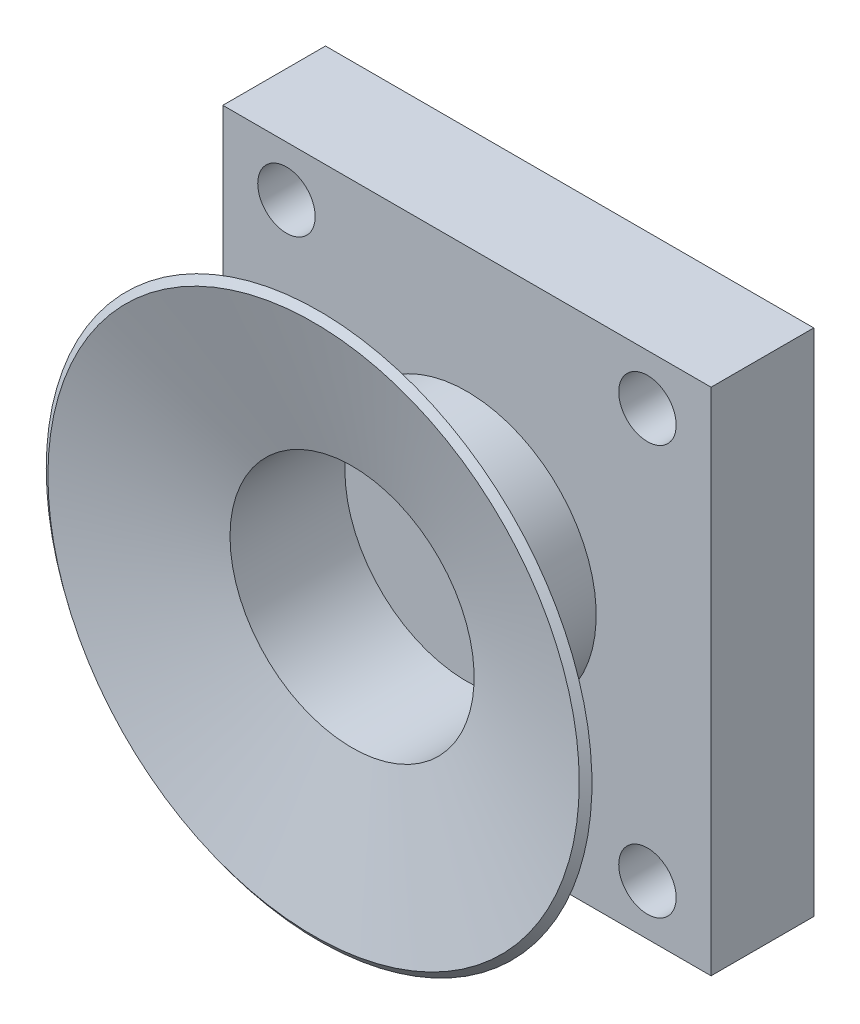
ISO-10303-21;
HEADER;
FILE_DESCRIPTION(('STEP AP214'),'2;1');
FILE_NAME('part.step','',(''),(''),'','','');
FILE_SCHEMA(('AUTOMOTIVE_DESIGN { 1 0 10303 214 1 1 1 1 }'));
ENDSEC;
DATA;
#1=APPLICATION_CONTEXT('core data for automotive mechanical design processes');
#2=APPLICATION_PROTOCOL_DEFINITION('international standard','automotive_design',2000,#1);
#3=PRODUCT_CONTEXT('',#1,'mechanical');
#4=PRODUCT('Part','Part','',(#3));
#5=PRODUCT_RELATED_PRODUCT_CATEGORY('part','',(#4));
#6=PRODUCT_DEFINITION_FORMATION('','',#4);
#7=PRODUCT_DEFINITION_CONTEXT('part definition',#1,'design');
#8=PRODUCT_DEFINITION('design','',#6,#7);
#9=PRODUCT_DEFINITION_SHAPE('','',#8);
#10=(LENGTH_UNIT() NAMED_UNIT(*) SI_UNIT(.MILLI.,.METRE.));
#11=(NAMED_UNIT(*) PLANE_ANGLE_UNIT() SI_UNIT($,.RADIAN.));
#12=(NAMED_UNIT(*) SI_UNIT($,.STERADIAN.) SOLID_ANGLE_UNIT());
#13=UNCERTAINTY_MEASURE_WITH_UNIT(LENGTH_MEASURE(1.E-05),#10,'distance_accuracy_value','');
#14=(GEOMETRIC_REPRESENTATION_CONTEXT(3) GLOBAL_UNCERTAINTY_ASSIGNED_CONTEXT((#13)) GLOBAL_UNIT_ASSIGNED_CONTEXT((#10,
#11,#12)) REPRESENTATION_CONTEXT('',''));
#15=CARTESIAN_POINT('',(0.,0.,0.));
#16=DIRECTION('',(0.,0.,1.));
#17=DIRECTION('',(1.,0.,0.));
#18=AXIS2_PLACEMENT_3D('',#15,#16,#17);
#19=CARTESIAN_POINT('',(0.,0.,7.15));
#20=DIRECTION('',(0.,0.,-1.));
#21=DIRECTION('',(-1.,0.,0.));
#22=AXIS2_PLACEMENT_3D('',#19,#20,#21);
#23=PLANE('',#22);
#24=CARTESIAN_POINT('',(17.,17.75,7.15));
#25=DIRECTION('',(0.,0.,-1.));
#26=DIRECTION('',(-1.,0.,0.));
#27=AXIS2_PLACEMENT_3D('',#24,#25,#26);
#28=CIRCLE('',#27,9.);
#29=CARTESIAN_POINT('',(8.,17.75,7.15));
#30=VERTEX_POINT('',#29);
#31=EDGE_CURVE('E312',#30,#30,#28,.T.);
#32=ORIENTED_EDGE('',*,*,#31,.T.);
#33=EDGE_LOOP('',(#32));
#34=FACE_BOUND('',#33,.T.);
#35=DIRECTION('',(1.,0.,0.));
#36=VECTOR('',#35,1.);
#37=CARTESIAN_POINT('',(34.,0.,7.15));
#38=LINE('',#37,#36);
#39=CARTESIAN_POINT('',(0.,0.,7.15));
#40=VERTEX_POINT('',#39);
#41=CARTESIAN_POINT('',(34.,0.,7.15));
#42=VERTEX_POINT('',#41);
#43=EDGE_CURVE('E90',#40,#42,#38,.T.);
#44=ORIENTED_EDGE('',*,*,#43,.T.);
#45=DIRECTION('',(0.,1.,0.));
#46=VECTOR('',#45,1.);
#47=CARTESIAN_POINT('',(34.,35.5,7.15));
#48=LINE('',#47,#46);
#49=CARTESIAN_POINT('',(34.,35.5,7.15));
#50=VERTEX_POINT('',#49);
#51=EDGE_CURVE('E85',#42,#50,#48,.T.);
#52=ORIENTED_EDGE('',*,*,#51,.T.);
#53=DIRECTION('',(-1.,0.,0.));
#54=VECTOR('',#53,1.);
#55=CARTESIAN_POINT('',(0.,35.5,7.15));
#56=LINE('',#55,#54);
#57=CARTESIAN_POINT('',(0.,35.5,7.15));
#58=VERTEX_POINT('',#57);
#59=EDGE_CURVE('E88',#50,#58,#56,.T.);
#60=ORIENTED_EDGE('',*,*,#59,.T.);
#61=DIRECTION('',(0.,-1.,0.));
#62=VECTOR('',#61,1.);
#63=CARTESIAN_POINT('',(0.,0.,7.15));
#64=LINE('',#63,#62);
#65=EDGE_CURVE('E54',#58,#40,#64,.T.);
#66=ORIENTED_EDGE('',*,*,#65,.T.);
#67=EDGE_LOOP('',(#44,#52,#60,#66));
#68=FACE_BOUND('',#67,.T.);
#69=CARTESIAN_POINT('',(4.43152626751353,3.5,7.15));
#70=DIRECTION('',(0.,0.,1.));
#71=DIRECTION('',(1.,0.,0.));
#72=AXIS2_PLACEMENT_3D('',#69,#70,#71);
#73=CIRCLE('',#72,2.);
#74=CARTESIAN_POINT('',(6.43152626751353,3.5,7.15));
#75=VERTEX_POINT('',#74);
#76=EDGE_CURVE('E107',#75,#75,#73,.T.);
#77=ORIENTED_EDGE('',*,*,#76,.F.);
#78=EDGE_LOOP('',(#77));
#79=FACE_BOUND('',#78,.T.);
#80=CARTESIAN_POINT('',(29.5684737324865,3.5,7.15));
#81=DIRECTION('',(0.,0.,1.));
#82=DIRECTION('',(-1.,0.,0.));
#83=AXIS2_PLACEMENT_3D('',#80,#81,#82);
#84=CIRCLE('',#83,2.);
#85=CARTESIAN_POINT('',(27.5684737324865,3.5,7.15));
#86=VERTEX_POINT('',#85);
#87=EDGE_CURVE('E143',#86,#86,#84,.T.);
#88=ORIENTED_EDGE('',*,*,#87,.F.);
#89=EDGE_LOOP('',(#88));
#90=FACE_BOUND('',#89,.T.);
#91=CARTESIAN_POINT('',(29.5684737324865,32.,7.15));
#92=DIRECTION('',(0.,0.,1.));
#93=DIRECTION('',(1.,0.,0.));
#94=AXIS2_PLACEMENT_3D('',#91,#92,#93);
#95=CIRCLE('',#94,2.);
#96=CARTESIAN_POINT('',(31.5684737324865,32.,7.15));
#97=VERTEX_POINT('',#96);
#98=EDGE_CURVE('E138',#97,#97,#95,.T.);
#99=ORIENTED_EDGE('',*,*,#98,.F.);
#100=EDGE_LOOP('',(#99));
#101=FACE_BOUND('',#100,.T.);
#102=CARTESIAN_POINT('',(4.43152626751353,32.,7.15));
#103=DIRECTION('',(0.,0.,1.));
#104=DIRECTION('',(-1.,0.,0.));
#105=AXIS2_PLACEMENT_3D('',#102,#103,#104);
#106=CIRCLE('',#105,2.);
#107=CARTESIAN_POINT('',(2.43152626751353,32.,7.15));
#108=VERTEX_POINT('',#107);
#109=EDGE_CURVE('E128',#108,#108,#106,.T.);
#110=ORIENTED_EDGE('',*,*,#109,.F.);
#111=EDGE_LOOP('',(#110));
#112=FACE_BOUND('',#111,.T.);
#113=ADVANCED_FACE('F37',(#34,#68,#79,#90,#101,#112),#23,.F.);
#114=CARTESIAN_POINT('',(0.,0.,0.));
#115=DIRECTION('',(0.,0.,-1.));
#116=DIRECTION('',(-1.,0.,0.));
#117=AXIS2_PLACEMENT_3D('',#114,#115,#116);
#118=PLANE('',#117);
#119=CARTESIAN_POINT('',(29.5684737324865,32.,0.));
#120=DIRECTION('',(0.,0.,1.));
#121=DIRECTION('',(1.,0.,0.));
#122=AXIS2_PLACEMENT_3D('',#119,#120,#121);
#123=CIRCLE('',#122,2.);
#124=CARTESIAN_POINT('',(31.5684737324865,32.,0.));
#125=VERTEX_POINT('',#124);
#126=EDGE_CURVE('E132',#125,#125,#123,.T.);
#127=ORIENTED_EDGE('',*,*,#126,.T.);
#128=EDGE_LOOP('',(#127));
#129=FACE_BOUND('',#128,.T.);
#130=CARTESIAN_POINT('',(4.43152626751353,3.5,0.));
#131=DIRECTION('',(0.,0.,1.));
#132=DIRECTION('',(1.,0.,0.));
#133=AXIS2_PLACEMENT_3D('',#130,#131,#132);
#134=CIRCLE('',#133,2.);
#135=CARTESIAN_POINT('',(6.43152626751353,3.5,0.));
#136=VERTEX_POINT('',#135);
#137=EDGE_CURVE('E146',#136,#136,#134,.T.);
#138=ORIENTED_EDGE('',*,*,#137,.T.);
#139=EDGE_LOOP('',(#138));
#140=FACE_BOUND('',#139,.T.);
#141=DIRECTION('',(1.,0.,0.));
#142=VECTOR('',#141,1.);
#143=CARTESIAN_POINT('',(34.,0.,0.));
#144=LINE('',#143,#142);
#145=CARTESIAN_POINT('',(0.,0.,0.));
#146=VERTEX_POINT('',#145);
#147=CARTESIAN_POINT('',(34.,0.,0.));
#148=VERTEX_POINT('',#147);
#149=EDGE_CURVE('E104',#146,#148,#144,.T.);
#150=ORIENTED_EDGE('',*,*,#149,.F.);
#151=DIRECTION('',(0.,-1.,0.));
#152=VECTOR('',#151,1.);
#153=CARTESIAN_POINT('',(0.,0.,0.));
#154=LINE('',#153,#152);
#155=CARTESIAN_POINT('',(0.,35.5,0.));
#156=VERTEX_POINT('',#155);
#157=EDGE_CURVE('E77',#156,#146,#154,.T.);
#158=ORIENTED_EDGE('',*,*,#157,.F.);
#159=DIRECTION('',(-1.,0.,0.));
#160=VECTOR('',#159,1.);
#161=CARTESIAN_POINT('',(0.,35.5,0.));
#162=LINE('',#161,#160);
#163=CARTESIAN_POINT('',(34.,35.5,0.));
#164=VERTEX_POINT('',#163);
#165=EDGE_CURVE('E71',#164,#156,#162,.T.);
#166=ORIENTED_EDGE('',*,*,#165,.F.);
#167=DIRECTION('',(0.,1.,0.));
#168=VECTOR('',#167,1.);
#169=CARTESIAN_POINT('',(34.,35.5,0.));
#170=LINE('',#169,#168);
#171=EDGE_CURVE('E95',#148,#164,#170,.T.);
#172=ORIENTED_EDGE('',*,*,#171,.F.);
#173=EDGE_LOOP('',(#150,#158,#166,#172));
#174=FACE_BOUND('',#173,.T.);
#175=CARTESIAN_POINT('',(29.5684737324865,3.5,0.));
#176=DIRECTION('',(0.,0.,1.));
#177=DIRECTION('',(-1.,0.,0.));
#178=AXIS2_PLACEMENT_3D('',#175,#176,#177);
#179=CIRCLE('',#178,2.);
#180=CARTESIAN_POINT('',(27.5684737324865,3.5,0.));
#181=VERTEX_POINT('',#180);
#182=EDGE_CURVE('E123',#181,#181,#179,.T.);
#183=ORIENTED_EDGE('',*,*,#182,.T.);
#184=EDGE_LOOP('',(#183));
#185=FACE_BOUND('',#184,.T.);
#186=CARTESIAN_POINT('',(4.43152626751353,32.,0.));
#187=DIRECTION('',(0.,0.,1.));
#188=DIRECTION('',(-1.,0.,0.));
#189=AXIS2_PLACEMENT_3D('',#186,#187,#188);
#190=CIRCLE('',#189,2.);
#191=CARTESIAN_POINT('',(2.43152626751353,32.,0.));
#192=VERTEX_POINT('',#191);
#193=EDGE_CURVE('E126',#192,#192,#190,.T.);
#194=ORIENTED_EDGE('',*,*,#193,.T.);
#195=EDGE_LOOP('',(#194));
#196=FACE_BOUND('',#195,.T.);
#197=ADVANCED_FACE('F115',(#129,#140,#174,#185,#196),#118,.T.);
#198=CARTESIAN_POINT('',(34.,0.,7.15));
#199=DIRECTION('',(0.,1.,0.));
#200=DIRECTION('',(-1.,0.,0.));
#201=AXIS2_PLACEMENT_3D('',#198,#199,#200);
#202=PLANE('',#201);
#203=ORIENTED_EDGE('',*,*,#149,.T.);
#204=DIRECTION('',(0.,0.,-1.));
#205=VECTOR('',#204,1.);
#206=CARTESIAN_POINT('',(34.,0.,7.15));
#207=LINE('',#206,#205);
#208=EDGE_CURVE('E46',#42,#148,#207,.T.);
#209=ORIENTED_EDGE('',*,*,#208,.F.);
#210=ORIENTED_EDGE('',*,*,#43,.F.);
#211=DIRECTION('',(0.,0.,-1.));
#212=VECTOR('',#211,1.);
#213=CARTESIAN_POINT('',(0.,0.,7.15));
#214=LINE('',#213,#212);
#215=EDGE_CURVE('E100',#40,#146,#214,.T.);
#216=ORIENTED_EDGE('',*,*,#215,.T.);
#217=EDGE_LOOP('',(#203,#209,#210,#216));
#218=FACE_BOUND('',#217,.T.);
#219=ADVANCED_FACE('F39',(#218),#202,.F.);
#220=CARTESIAN_POINT('',(34.,35.5,7.15));
#221=DIRECTION('',(-1.,0.,0.));
#222=DIRECTION('',(0.,-1.,0.));
#223=AXIS2_PLACEMENT_3D('',#220,#221,#222);
#224=PLANE('',#223);
#225=ORIENTED_EDGE('',*,*,#171,.T.);
#226=DIRECTION('',(0.,0.,-1.));
#227=VECTOR('',#226,1.);
#228=CARTESIAN_POINT('',(34.,35.5,7.15));
#229=LINE('',#228,#227);
#230=EDGE_CURVE('E93',#50,#164,#229,.T.);
#231=ORIENTED_EDGE('',*,*,#230,.F.);
#232=ORIENTED_EDGE('',*,*,#51,.F.);
#233=ORIENTED_EDGE('',*,*,#208,.T.);
#234=EDGE_LOOP('',(#225,#231,#232,#233));
#235=FACE_BOUND('',#234,.T.);
#236=ADVANCED_FACE('F94',(#235),#224,.F.);
#237=CARTESIAN_POINT('',(0.,35.5,7.15));
#238=DIRECTION('',(0.,-1.,0.));
#239=DIRECTION('',(0.,0.,-1.));
#240=AXIS2_PLACEMENT_3D('',#237,#238,#239);
#241=PLANE('',#240);
#242=ORIENTED_EDGE('',*,*,#165,.T.);
#243=DIRECTION('',(0.,0.,-1.));
#244=VECTOR('',#243,1.);
#245=CARTESIAN_POINT('',(0.,35.5,7.15));
#246=LINE('',#245,#244);
#247=EDGE_CURVE('E96',#58,#156,#246,.T.);
#248=ORIENTED_EDGE('',*,*,#247,.F.);
#249=ORIENTED_EDGE('',*,*,#59,.F.);
#250=ORIENTED_EDGE('',*,*,#230,.T.);
#251=EDGE_LOOP('',(#242,#248,#249,#250));
#252=FACE_BOUND('',#251,.T.);
#253=ADVANCED_FACE('F98',(#252),#241,.F.);
#254=CARTESIAN_POINT('',(0.,0.,7.15));
#255=DIRECTION('',(1.,0.,0.));
#256=DIRECTION('',(0.,0.,-1.));
#257=AXIS2_PLACEMENT_3D('',#254,#255,#256);
#258=PLANE('',#257);
#259=ORIENTED_EDGE('',*,*,#157,.T.);
#260=ORIENTED_EDGE('',*,*,#215,.F.);
#261=ORIENTED_EDGE('',*,*,#65,.F.);
#262=ORIENTED_EDGE('',*,*,#247,.T.);
#263=EDGE_LOOP('',(#259,#260,#261,#262));
#264=FACE_BOUND('',#263,.T.);
#265=ADVANCED_FACE('F157',(#264),#258,.F.);
#266=CARTESIAN_POINT('',(4.43152626751353,3.5,7.15));
#267=DIRECTION('',(0.,0.,-1.));
#268=DIRECTION('',(-1.,0.,0.));
#269=AXIS2_PLACEMENT_3D('',#266,#267,#268);
#270=CYLINDRICAL_SURFACE('',#269,2.);
#271=ORIENTED_EDGE('',*,*,#76,.T.);
#272=EDGE_LOOP('',(#271));
#273=FACE_BOUND('',#272,.T.);
#274=ORIENTED_EDGE('',*,*,#137,.F.);
#275=EDGE_LOOP('',(#274));
#276=FACE_BOUND('',#275,.T.);
#277=ADVANCED_FACE('F154',(#273,#276),#270,.F.);
#278=CARTESIAN_POINT('',(29.5684737324865,3.5,7.15));
#279=DIRECTION('',(0.,0.,-1.));
#280=DIRECTION('',(-1.,0.,0.));
#281=AXIS2_PLACEMENT_3D('',#278,#279,#280);
#282=CYLINDRICAL_SURFACE('',#281,2.);
#283=ORIENTED_EDGE('',*,*,#87,.T.);
#284=EDGE_LOOP('',(#283));
#285=FACE_BOUND('',#284,.T.);
#286=ORIENTED_EDGE('',*,*,#182,.F.);
#287=EDGE_LOOP('',(#286));
#288=FACE_BOUND('',#287,.T.);
#289=ADVANCED_FACE('F156',(#285,#288),#282,.F.);
#290=CARTESIAN_POINT('',(29.5684737324865,32.,7.15));
#291=DIRECTION('',(0.,0.,-1.));
#292=DIRECTION('',(-1.,0.,0.));
#293=AXIS2_PLACEMENT_3D('',#290,#291,#292);
#294=CYLINDRICAL_SURFACE('',#293,2.);
#295=ORIENTED_EDGE('',*,*,#98,.T.);
#296=EDGE_LOOP('',(#295));
#297=FACE_BOUND('',#296,.T.);
#298=ORIENTED_EDGE('',*,*,#126,.F.);
#299=EDGE_LOOP('',(#298));
#300=FACE_BOUND('',#299,.T.);
#301=ADVANCED_FACE('F164',(#297,#300),#294,.F.);
#302=CARTESIAN_POINT('',(4.43152626751353,32.,7.15));
#303=DIRECTION('',(0.,0.,-1.));
#304=DIRECTION('',(-1.,0.,0.));
#305=AXIS2_PLACEMENT_3D('',#302,#303,#304);
#306=CYLINDRICAL_SURFACE('',#305,2.);
#307=ORIENTED_EDGE('',*,*,#109,.T.);
#308=EDGE_LOOP('',(#307));
#309=FACE_BOUND('',#308,.T.);
#310=ORIENTED_EDGE('',*,*,#193,.F.);
#311=EDGE_LOOP('',(#310));
#312=FACE_BOUND('',#311,.T.);
#313=ADVANCED_FACE('F204',(#309,#312),#306,.F.);
#314=CARTESIAN_POINT('',(17.,17.75,7.15));
#315=DIRECTION('',(0.,0.,-1.));
#316=DIRECTION('',(-1.,0.,0.));
#317=AXIS2_PLACEMENT_3D('',#314,#315,#316);
#318=CYLINDRICAL_SURFACE('',#317,9.);
#319=CARTESIAN_POINT('',(17.,17.75,14.7663365060105));
#320=DIRECTION('',(0.,0.,-1.));
#321=DIRECTION('',(-1.,0.,0.));
#322=AXIS2_PLACEMENT_3D('',#319,#320,#321);
#323=CIRCLE('',#322,9.);
#324=CARTESIAN_POINT('',(8.,17.75,14.7663365060105));
#325=VERTEX_POINT('',#324);
#326=EDGE_CURVE('E129',#325,#325,#323,.T.);
#327=ORIENTED_EDGE('',*,*,#326,.T.);
#328=EDGE_LOOP('',(#327));
#329=FACE_BOUND('',#328,.T.);
#330=ORIENTED_EDGE('',*,*,#31,.F.);
#331=EDGE_LOOP('',(#330));
#332=FACE_BOUND('',#331,.T.);
#333=ADVANCED_FACE('F200',(#329,#332),#318,.T.);
#334=CARTESIAN_POINT('',(17.,17.75,14.7663365060105));
#335=DIRECTION('',(0.,0.,1.));
#336=DIRECTION('',(1.,0.,0.));
#337=AXIS2_PLACEMENT_3D('',#334,#335,#336);
#338=CONICAL_SURFACE('',#337,9.,1.30899693899575);
#339=CARTESIAN_POINT('',(17.,17.75,17.4458284303217));
#340=DIRECTION('',(0.,0.,-1.));
#341=DIRECTION('',(-1.,0.,0.));
#342=AXIS2_PLACEMENT_3D('',#339,#340,#341);
#343=CIRCLE('',#342,19.);
#344=CARTESIAN_POINT('',(-1.99999999999999,17.75,17.4458284303217));
#345=VERTEX_POINT('',#344);
#346=EDGE_CURVE('E135',#345,#345,#343,.T.);
#347=ORIENTED_EDGE('',*,*,#346,.T.);
#348=EDGE_LOOP('',(#347));
#349=FACE_BOUND('',#348,.T.);
#350=ORIENTED_EDGE('',*,*,#326,.F.);
#351=EDGE_LOOP('',(#350));
#352=FACE_BOUND('',#351,.T.);
#353=ADVANCED_FACE('F196',(#349,#352),#338,.T.);
#354=CARTESIAN_POINT('',(17.,17.75,17.4458284303217));
#355=DIRECTION('',(0.,0.,-1.));
#356=DIRECTION('',(-1.,0.,0.));
#357=AXIS2_PLACEMENT_3D('',#354,#355,#356);
#358=CONICAL_SURFACE('',#357,19.,0.916297857297027);
#359=CARTESIAN_POINT('',(17.,17.75,17.8294919243112));
#360=DIRECTION('',(0.,0.,-1.));
#361=DIRECTION('',(-1.,0.,0.));
#362=AXIS2_PLACEMENT_3D('',#359,#360,#361);
#363=CIRCLE('',#362,18.5);
#364=CARTESIAN_POINT('',(-1.49999999999999,17.75,17.8294919243112));
#365=VERTEX_POINT('',#364);
#366=EDGE_CURVE('E316',#365,#365,#363,.T.);
#367=ORIENTED_EDGE('',*,*,#366,.T.);
#368=EDGE_LOOP('',(#367));
#369=FACE_BOUND('',#368,.T.);
#370=ORIENTED_EDGE('',*,*,#346,.F.);
#371=EDGE_LOOP('',(#370));
#372=FACE_BOUND('',#371,.T.);
#373=ADVANCED_FACE('F189',(#369,#372),#358,.T.);
#374=CARTESIAN_POINT('',(17.,17.75,15.15));
#375=DIRECTION('',(0.,0.,1.));
#376=DIRECTION('',(1.,0.,0.));
#377=AXIS2_PLACEMENT_3D('',#374,#375,#376);
#378=CONICAL_SURFACE('',#377,8.5,1.30899693899575);
#379=ORIENTED_EDGE('',*,*,#366,.F.);
#380=EDGE_LOOP('',(#379));
#381=FACE_BOUND('',#380,.T.);
#382=CARTESIAN_POINT('',(17.,17.75,15.15));
#383=DIRECTION('',(0.,0.,-1.));
#384=DIRECTION('',(-1.,0.,0.));
#385=AXIS2_PLACEMENT_3D('',#382,#383,#384);
#386=CIRCLE('',#385,8.5);
#387=CARTESIAN_POINT('',(8.5,17.75,15.15));
#388=VERTEX_POINT('',#387);
#389=EDGE_CURVE('E313',#388,#388,#386,.T.);
#390=ORIENTED_EDGE('',*,*,#389,.T.);
#391=EDGE_LOOP('',(#390));
#392=FACE_BOUND('',#391,.T.);
#393=ADVANCED_FACE('F181',(#381,#392),#378,.F.);
#394=CARTESIAN_POINT('',(17.,17.75,7.15));
#395=DIRECTION('',(0.,0.,-1.));
#396=DIRECTION('',(-1.,0.,0.));
#397=AXIS2_PLACEMENT_3D('',#394,#395,#396);
#398=CYLINDRICAL_SURFACE('',#397,8.5);
#399=ORIENTED_EDGE('',*,*,#389,.F.);
#400=EDGE_LOOP('',(#399));
#401=FACE_BOUND('',#400,.T.);
#402=CARTESIAN_POINT('',(17.,17.75,7.15));
#403=DIRECTION('',(0.,0.,-1.));
#404=DIRECTION('',(-1.,0.,0.));
#405=AXIS2_PLACEMENT_3D('',#402,#403,#404);
#406=CIRCLE('',#405,8.5);
#407=CARTESIAN_POINT('',(8.5,17.75,7.15));
#408=VERTEX_POINT('',#407);
#409=EDGE_CURVE('E11',#408,#408,#406,.T.);
#410=ORIENTED_EDGE('',*,*,#409,.T.);
#411=EDGE_LOOP('',(#410));
#412=FACE_BOUND('',#411,.T.);
#413=ADVANCED_FACE('F176',(#401,#412),#398,.F.);
#414=ORIENTED_EDGE('',*,*,#409,.F.);
#415=EDGE_LOOP('',(#414));
#416=FACE_BOUND('',#415,.T.);
#417=ADVANCED_FACE('F171',(#416),#23,.F.);
#418=CLOSED_SHELL('',(#113,#197,#219,#236,#253,#265,#277,#289,#301,#313,#333,#353,#373,#393,
#413,#417));
#419=MANIFOLD_SOLID_BREP('B2',#418);
#420=ADVANCED_BREP_SHAPE_REPRESENTATION('',(#18,#419),#14);
#421=SHAPE_DEFINITION_REPRESENTATION(#9,#420);
ENDSEC;
END-ISO-10303-21;
